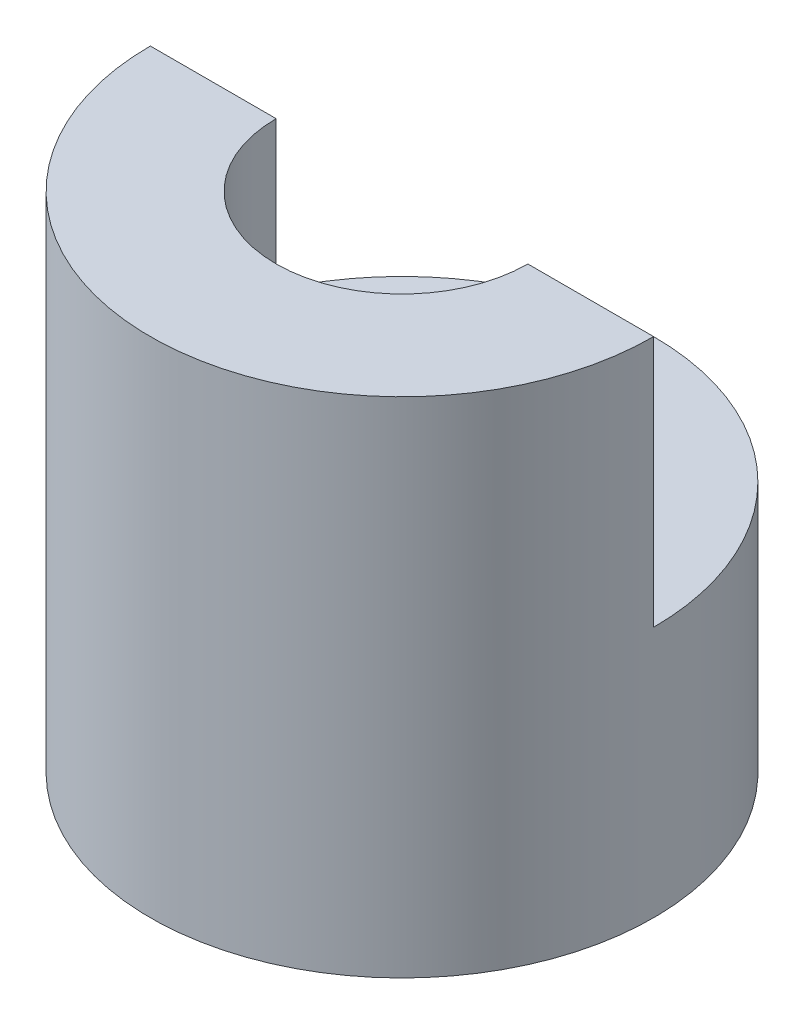
ISO-10303-21;
HEADER;
FILE_DESCRIPTION(('STEP AP214'),'2;1');
FILE_NAME('part.step','',(''),(''),'','','');
FILE_SCHEMA(('AUTOMOTIVE_DESIGN { 1 0 10303 214 1 1 1 1 }'));
ENDSEC;
DATA;
#1=APPLICATION_CONTEXT('core data for automotive mechanical design processes');
#2=APPLICATION_PROTOCOL_DEFINITION('international standard','automotive_design',2000,#1);
#3=PRODUCT_CONTEXT('',#1,'mechanical');
#4=PRODUCT('Part','Part','',(#3));
#5=PRODUCT_RELATED_PRODUCT_CATEGORY('part','',(#4));
#6=PRODUCT_DEFINITION_FORMATION('','',#4);
#7=PRODUCT_DEFINITION_CONTEXT('part definition',#1,'design');
#8=PRODUCT_DEFINITION('design','',#6,#7);
#9=PRODUCT_DEFINITION_SHAPE('','',#8);
#10=(LENGTH_UNIT() NAMED_UNIT(*) SI_UNIT(.MILLI.,.METRE.));
#11=(NAMED_UNIT(*) PLANE_ANGLE_UNIT() SI_UNIT($,.RADIAN.));
#12=(NAMED_UNIT(*) SI_UNIT($,.STERADIAN.) SOLID_ANGLE_UNIT());
#13=UNCERTAINTY_MEASURE_WITH_UNIT(LENGTH_MEASURE(1.E-05),#10,'distance_accuracy_value','');
#14=(GEOMETRIC_REPRESENTATION_CONTEXT(3) GLOBAL_UNCERTAINTY_ASSIGNED_CONTEXT((#13)) GLOBAL_UNIT_ASSIGNED_CONTEXT((#10,
#11,#12)) REPRESENTATION_CONTEXT('',''));
#15=CARTESIAN_POINT('',(0.,0.,0.));
#16=DIRECTION('',(0.,0.,1.));
#17=DIRECTION('',(1.,0.,0.));
#18=AXIS2_PLACEMENT_3D('',#15,#16,#17);
#19=CARTESIAN_POINT('',(0.,20.,0.));
#20=DIRECTION('',(0.,1.,0.));
#21=DIRECTION('',(0.,0.,1.));
#22=AXIS2_PLACEMENT_3D('',#19,#20,#21);
#23=PLANE('',#22);
#24=DIRECTION('',(1.,0.,0.));
#25=VECTOR('',#24,1.);
#26=CARTESIAN_POINT('',(5.,20.,0.));
#27=LINE('',#26,#25);
#28=CARTESIAN_POINT('',(5.,20.,0.));
#29=VERTEX_POINT('',#28);
#30=CARTESIAN_POINT('',(10.,20.,0.));
#31=VERTEX_POINT('',#30);
#32=EDGE_CURVE('E72',#29,#31,#27,.T.);
#33=ORIENTED_EDGE('',*,*,#32,.F.);
#34=CARTESIAN_POINT('',(0.,20.,0.));
#35=DIRECTION('',(0.,1.,0.));
#36=DIRECTION('',(0.,0.,1.));
#37=AXIS2_PLACEMENT_3D('',#34,#35,#36);
#38=CIRCLE('',#37,5.);
#39=CARTESIAN_POINT('',(-5.,20.,0.));
#40=VERTEX_POINT('',#39);
#41=EDGE_CURVE('E101',#40,#29,#38,.T.);
#42=ORIENTED_EDGE('',*,*,#41,.F.);
#43=DIRECTION('',(1.,0.,0.));
#44=VECTOR('',#43,1.);
#45=CARTESIAN_POINT('',(-10.,20.,0.));
#46=LINE('',#45,#44);
#47=CARTESIAN_POINT('',(-10.,20.,0.));
#48=VERTEX_POINT('',#47);
#49=EDGE_CURVE('E170',#48,#40,#46,.T.);
#50=ORIENTED_EDGE('',*,*,#49,.F.);
#51=CARTESIAN_POINT('',(0.,20.,0.));
#52=DIRECTION('',(0.,-1.,0.));
#53=DIRECTION('',(0.,0.,-1.));
#54=AXIS2_PLACEMENT_3D('',#51,#52,#53);
#55=CIRCLE('',#54,10.);
#56=EDGE_CURVE('E11',#31,#48,#55,.T.);
#57=ORIENTED_EDGE('',*,*,#56,.F.);
#58=EDGE_LOOP('',(#33,#42,#50,#57));
#59=FACE_BOUND('',#58,.T.);
#60=ADVANCED_FACE('F33',(#59),#23,.T.);
#61=CARTESIAN_POINT('',(0.,0.,0.));
#62=DIRECTION('',(0.,-1.,0.));
#63=DIRECTION('',(0.,0.,-1.));
#64=AXIS2_PLACEMENT_3D('',#61,#62,#63);
#65=CYLINDRICAL_SURFACE('',#64,10.);
#66=DIRECTION('',(0.,1.,0.));
#67=VECTOR('',#66,1.);
#68=CARTESIAN_POINT('',(10.,10.,0.));
#69=LINE('',#68,#67);
#70=CARTESIAN_POINT('',(10.,10.,0.));
#71=VERTEX_POINT('',#70);
#72=EDGE_CURVE('E56',#71,#31,#69,.T.);
#73=ORIENTED_EDGE('',*,*,#72,.T.);
#74=ORIENTED_EDGE('',*,*,#56,.T.);
#75=DIRECTION('',(0.,1.,0.));
#76=VECTOR('',#75,1.);
#77=CARTESIAN_POINT('',(-10.,10.,0.));
#78=LINE('',#77,#76);
#79=CARTESIAN_POINT('',(-10.,10.,0.));
#80=VERTEX_POINT('',#79);
#81=EDGE_CURVE('E76',#80,#48,#78,.T.);
#82=ORIENTED_EDGE('',*,*,#81,.F.);
#83=CARTESIAN_POINT('',(0.,10.,0.));
#84=DIRECTION('',(0.,1.,0.));
#85=DIRECTION('',(0.,0.,1.));
#86=AXIS2_PLACEMENT_3D('',#83,#84,#85);
#87=CIRCLE('',#86,10.);
#88=EDGE_CURVE('E82',#71,#80,#87,.T.);
#89=ORIENTED_EDGE('',*,*,#88,.F.);
#90=EDGE_LOOP('',(#73,#74,#82,#89));
#91=FACE_BOUND('',#90,.T.);
#92=CARTESIAN_POINT('',(0.,0.,0.));
#93=DIRECTION('',(0.,-1.,0.));
#94=DIRECTION('',(0.,0.,-1.));
#95=AXIS2_PLACEMENT_3D('',#92,#93,#94);
#96=CIRCLE('',#95,10.);
#97=CARTESIAN_POINT('',(0.,0.,-10.));
#98=VERTEX_POINT('',#97);
#99=EDGE_CURVE('E40',#98,#98,#96,.T.);
#100=ORIENTED_EDGE('',*,*,#99,.F.);
#101=EDGE_LOOP('',(#100));
#102=FACE_BOUND('',#101,.T.);
#103=ADVANCED_FACE('F89',(#91,#102),#65,.T.);
#104=CARTESIAN_POINT('',(0.,0.,0.));
#105=DIRECTION('',(0.,-1.,0.));
#106=DIRECTION('',(0.,0.,-1.));
#107=AXIS2_PLACEMENT_3D('',#104,#105,#106);
#108=PLANE('',#107);
#109=CARTESIAN_POINT('',(0.,0.,0.));
#110=DIRECTION('',(0.,1.,0.));
#111=DIRECTION('',(0.,0.,1.));
#112=AXIS2_PLACEMENT_3D('',#109,#110,#111);
#113=CIRCLE('',#112,5.);
#114=CARTESIAN_POINT('',(0.,0.,5.));
#115=VERTEX_POINT('',#114);
#116=EDGE_CURVE('E98',#115,#115,#113,.T.);
#117=ORIENTED_EDGE('',*,*,#116,.T.);
#118=EDGE_LOOP('',(#117));
#119=FACE_BOUND('',#118,.T.);
#120=ORIENTED_EDGE('',*,*,#99,.T.);
#121=EDGE_LOOP('',(#120));
#122=FACE_BOUND('',#121,.T.);
#123=ADVANCED_FACE('F106',(#119,#122),#108,.T.);
#124=CARTESIAN_POINT('',(0.,0.,0.));
#125=DIRECTION('',(0.,1.,0.));
#126=DIRECTION('',(0.,0.,1.));
#127=AXIS2_PLACEMENT_3D('',#124,#125,#126);
#128=CYLINDRICAL_SURFACE('',#127,5.);
#129=ORIENTED_EDGE('',*,*,#41,.T.);
#130=DIRECTION('',(0.,1.,0.));
#131=VECTOR('',#130,1.);
#132=CARTESIAN_POINT('',(5.,10.,0.));
#133=LINE('',#132,#131);
#134=CARTESIAN_POINT('',(5.,10.,0.));
#135=VERTEX_POINT('',#134);
#136=EDGE_CURVE('E93',#135,#29,#133,.T.);
#137=ORIENTED_EDGE('',*,*,#136,.F.);
#138=CARTESIAN_POINT('',(0.,10.,0.));
#139=DIRECTION('',(0.,-1.,0.));
#140=DIRECTION('',(0.,0.,-1.));
#141=AXIS2_PLACEMENT_3D('',#138,#139,#140);
#142=CIRCLE('',#141,5.);
#143=CARTESIAN_POINT('',(-5.,10.,0.));
#144=VERTEX_POINT('',#143);
#145=EDGE_CURVE('E81',#144,#135,#142,.T.);
#146=ORIENTED_EDGE('',*,*,#145,.F.);
#147=DIRECTION('',(0.,1.,0.));
#148=VECTOR('',#147,1.);
#149=CARTESIAN_POINT('',(-5.,10.,0.));
#150=LINE('',#149,#148);
#151=EDGE_CURVE('E79',#144,#40,#150,.T.);
#152=ORIENTED_EDGE('',*,*,#151,.T.);
#153=EDGE_LOOP('',(#129,#137,#146,#152));
#154=FACE_BOUND('',#153,.T.);
#155=ORIENTED_EDGE('',*,*,#116,.F.);
#156=EDGE_LOOP('',(#155));
#157=FACE_BOUND('',#156,.T.);
#158=ADVANCED_FACE('F112',(#154,#157),#128,.F.);
#159=CARTESIAN_POINT('',(5.,10.,0.));
#160=DIRECTION('',(0.,0.,1.));
#161=DIRECTION('',(1.,0.,0.));
#162=AXIS2_PLACEMENT_3D('',#159,#160,#161);
#163=PLANE('',#162);
#164=ORIENTED_EDGE('',*,*,#32,.T.);
#165=ORIENTED_EDGE('',*,*,#72,.F.);
#166=DIRECTION('',(1.,0.,0.));
#167=VECTOR('',#166,1.);
#168=CARTESIAN_POINT('',(5.,10.,0.));
#169=LINE('',#168,#167);
#170=EDGE_CURVE('E86',#135,#71,#169,.T.);
#171=ORIENTED_EDGE('',*,*,#170,.F.);
#172=ORIENTED_EDGE('',*,*,#136,.T.);
#173=EDGE_LOOP('',(#164,#165,#171,#172));
#174=FACE_BOUND('',#173,.T.);
#175=ADVANCED_FACE('F119',(#174),#163,.F.);
#176=CARTESIAN_POINT('',(-10.,10.,0.));
#177=DIRECTION('',(0.,0.,1.));
#178=DIRECTION('',(1.,0.,0.));
#179=AXIS2_PLACEMENT_3D('',#176,#177,#178);
#180=PLANE('',#179);
#181=ORIENTED_EDGE('',*,*,#49,.T.);
#182=ORIENTED_EDGE('',*,*,#151,.F.);
#183=DIRECTION('',(1.,0.,0.));
#184=VECTOR('',#183,1.);
#185=CARTESIAN_POINT('',(-10.,10.,0.));
#186=LINE('',#185,#184);
#187=EDGE_CURVE('E47',#80,#144,#186,.T.);
#188=ORIENTED_EDGE('',*,*,#187,.F.);
#189=ORIENTED_EDGE('',*,*,#81,.T.);
#190=EDGE_LOOP('',(#181,#182,#188,#189));
#191=FACE_BOUND('',#190,.T.);
#192=ADVANCED_FACE('F74',(#191),#180,.F.);
#193=CARTESIAN_POINT('',(0.,10.,0.));
#194=DIRECTION('',(0.,1.,0.));
#195=DIRECTION('',(0.,0.,1.));
#196=AXIS2_PLACEMENT_3D('',#193,#194,#195);
#197=PLANE('',#196);
#198=ORIENTED_EDGE('',*,*,#88,.T.);
#199=ORIENTED_EDGE('',*,*,#187,.T.);
#200=ORIENTED_EDGE('',*,*,#145,.T.);
#201=ORIENTED_EDGE('',*,*,#170,.T.);
#202=EDGE_LOOP('',(#198,#199,#200,#201));
#203=FACE_BOUND('',#202,.T.);
#204=ADVANCED_FACE('F85',(#203),#197,.T.);
#205=CLOSED_SHELL('',(#60,#103,#123,#158,#175,#192,#204));
#206=MANIFOLD_SOLID_BREP('B2',#205);
#207=ADVANCED_BREP_SHAPE_REPRESENTATION('',(#18,#206),#14);
#208=SHAPE_DEFINITION_REPRESENTATION(#9,#207);
ENDSEC;
END-ISO-10303-21;
